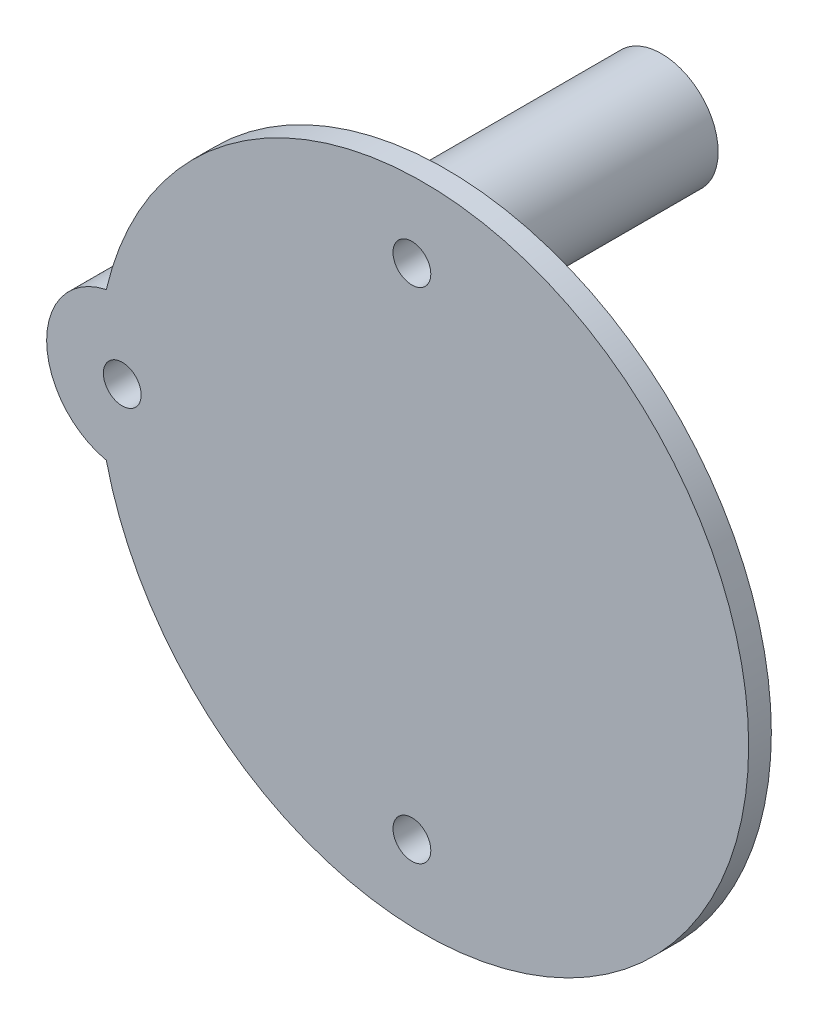
ISO-10303-21;
HEADER;
FILE_DESCRIPTION(('STEP AP214'),'2;1');
FILE_NAME('part.step','',(''),(''),'','','');
FILE_SCHEMA(('AUTOMOTIVE_DESIGN { 1 0 10303 214 1 1 1 1 }'));
ENDSEC;
DATA;
#1=APPLICATION_CONTEXT('core data for automotive mechanical design processes');
#2=APPLICATION_PROTOCOL_DEFINITION('international standard','automotive_design',2000,#1);
#3=PRODUCT_CONTEXT('',#1,'mechanical');
#4=PRODUCT('Part','Part','',(#3));
#5=PRODUCT_RELATED_PRODUCT_CATEGORY('part','',(#4));
#6=PRODUCT_DEFINITION_FORMATION('','',#4);
#7=PRODUCT_DEFINITION_CONTEXT('part definition',#1,'design');
#8=PRODUCT_DEFINITION('design','',#6,#7);
#9=PRODUCT_DEFINITION_SHAPE('','',#8);
#10=(LENGTH_UNIT() NAMED_UNIT(*) SI_UNIT(.MILLI.,.METRE.));
#11=(NAMED_UNIT(*) PLANE_ANGLE_UNIT() SI_UNIT($,.RADIAN.));
#12=(NAMED_UNIT(*) SI_UNIT($,.STERADIAN.) SOLID_ANGLE_UNIT());
#13=UNCERTAINTY_MEASURE_WITH_UNIT(LENGTH_MEASURE(1.E-05),#10,'distance_accuracy_value','');
#14=(GEOMETRIC_REPRESENTATION_CONTEXT(3) GLOBAL_UNCERTAINTY_ASSIGNED_CONTEXT((#13)) GLOBAL_UNIT_ASSIGNED_CONTEXT((#10,
#11,#12)) REPRESENTATION_CONTEXT('',''));
#15=CARTESIAN_POINT('',(0.,0.,0.));
#16=DIRECTION('',(0.,0.,1.));
#17=DIRECTION('',(1.,0.,0.));
#18=AXIS2_PLACEMENT_3D('',#15,#16,#17);
#19=CARTESIAN_POINT('',(29.,78.,0.));
#20=DIRECTION('',(0.,0.,1.));
#21=DIRECTION('',(1.,0.,0.));
#22=AXIS2_PLACEMENT_3D('',#19,#20,#21);
#23=PLANE('',#22);
#24=CARTESIAN_POINT('',(29.,78.,0.));
#25=DIRECTION('',(0.,0.,1.));
#26=DIRECTION('',(1.,0.,0.));
#27=AXIS2_PLACEMENT_3D('',#24,#25,#26);
#28=CIRCLE('',#27,7.5);
#29=CARTESIAN_POINT('',(36.5,78.,0.));
#30=VERTEX_POINT('',#29);
#31=EDGE_CURVE('E73',#30,#30,#28,.T.);
#32=ORIENTED_EDGE('',*,*,#31,.F.);
#33=EDGE_LOOP('',(#32));
#34=FACE_BOUND('',#33,.T.);
#35=CARTESIAN_POINT('',(29.,78.,0.));
#36=DIRECTION('',(0.,0.,1.));
#37=DIRECTION('',(1.,0.,0.));
#38=AXIS2_PLACEMENT_3D('',#35,#36,#37);
#39=CIRCLE('',#38,5.);
#40=CARTESIAN_POINT('',(34.,78.,0.));
#41=VERTEX_POINT('',#40);
#42=EDGE_CURVE('E93',#41,#41,#39,.T.);
#43=ORIENTED_EDGE('',*,*,#42,.T.);
#44=EDGE_LOOP('',(#43));
#45=FACE_BOUND('',#44,.T.);
#46=ADVANCED_FACE('F37',(#34,#45),#23,.F.);
#47=CARTESIAN_POINT('',(29.,78.,3.));
#48=DIRECTION('',(0.,0.,-1.));
#49=DIRECTION('',(-1.,0.,0.));
#50=AXIS2_PLACEMENT_3D('',#47,#48,#49);
#51=CYLINDRICAL_SURFACE('',#50,7.5);
#52=ORIENTED_EDGE('',*,*,#31,.T.);
#53=EDGE_LOOP('',(#52));
#54=FACE_BOUND('',#53,.T.);
#55=CARTESIAN_POINT('',(29.,78.,30.));
#56=DIRECTION('',(0.,0.,1.));
#57=DIRECTION('',(1.,0.,0.));
#58=AXIS2_PLACEMENT_3D('',#55,#56,#57);
#59=CIRCLE('',#58,7.5);
#60=CARTESIAN_POINT('',(36.5,78.,30.));
#61=VERTEX_POINT('',#60);
#62=EDGE_CURVE('E84',#61,#61,#59,.T.);
#63=ORIENTED_EDGE('',*,*,#62,.F.);
#64=EDGE_LOOP('',(#63));
#65=FACE_BOUND('',#64,.T.);
#66=ADVANCED_FACE('F39',(#54,#65),#51,.T.);
#67=CARTESIAN_POINT('',(29.,78.,3.));
#68=DIRECTION('',(0.,0.,-1.));
#69=DIRECTION('',(-1.,0.,0.));
#70=AXIS2_PLACEMENT_3D('',#67,#68,#69);
#71=CYLINDRICAL_SURFACE('',#70,5.);
#72=CARTESIAN_POINT('',(29.,78.,3.));
#73=DIRECTION('',(0.,0.,1.));
#74=DIRECTION('',(1.,0.,0.));
#75=AXIS2_PLACEMENT_3D('',#72,#73,#74);
#76=CIRCLE('',#75,5.);
#77=CARTESIAN_POINT('',(34.,78.,3.));
#78=VERTEX_POINT('',#77);
#79=EDGE_CURVE('E90',#78,#78,#76,.T.);
#80=ORIENTED_EDGE('',*,*,#79,.T.);
#81=EDGE_LOOP('',(#80));
#82=FACE_BOUND('',#81,.T.);
#83=ORIENTED_EDGE('',*,*,#42,.F.);
#84=EDGE_LOOP('',(#83));
#85=FACE_BOUND('',#84,.T.);
#86=ADVANCED_FACE('F153',(#82,#85),#71,.F.);
#87=CARTESIAN_POINT('',(29.,78.,3.));
#88=DIRECTION('',(0.,0.,1.));
#89=DIRECTION('',(1.,0.,0.));
#90=AXIS2_PLACEMENT_3D('',#87,#88,#89);
#91=PLANE('',#90);
#92=CARTESIAN_POINT('',(29.,78.,3.));
#93=DIRECTION('',(0.,0.,1.));
#94=DIRECTION('',(1.,0.,0.));
#95=AXIS2_PLACEMENT_3D('',#92,#93,#94);
#96=CIRCLE('',#95,2.5);
#97=CARTESIAN_POINT('',(31.5,78.,3.));
#98=VERTEX_POINT('',#97);
#99=EDGE_CURVE('E103',#98,#98,#96,.T.);
#100=ORIENTED_EDGE('',*,*,#99,.T.);
#101=EDGE_LOOP('',(#100));
#102=FACE_BOUND('',#101,.T.);
#103=ORIENTED_EDGE('',*,*,#79,.F.);
#104=EDGE_LOOP('',(#103));
#105=FACE_BOUND('',#104,.T.);
#106=ADVANCED_FACE('F160',(#102,#105),#91,.F.);
#107=CARTESIAN_POINT('',(-9.29999999999999,45.,33.));
#108=DIRECTION('',(0.,0.,-1.));
#109=DIRECTION('',(-1.,0.,0.));
#110=AXIS2_PLACEMENT_3D('',#107,#108,#109);
#111=CYLINDRICAL_SURFACE('',#110,10.);
#112=DIRECTION('',(0.,0.,-1.));
#113=VECTOR('',#112,1.);
#114=CARTESIAN_POINT('',(-11.4091892759593,54.7750355804048,33.));
#115=LINE('',#114,#113);
#116=CARTESIAN_POINT('',(-11.4091892759593,54.7750355804048,33.));
#117=VERTEX_POINT('',#116);
#118=CARTESIAN_POINT('',(-11.4091892759593,54.7750355804048,30.));
#119=VERTEX_POINT('',#118);
#120=EDGE_CURVE('E76',#117,#119,#115,.T.);
#121=ORIENTED_EDGE('',*,*,#120,.T.);
#122=CARTESIAN_POINT('',(-9.29999999999999,45.,30.));
#123=DIRECTION('',(0.,0.,1.));
#124=DIRECTION('',(1.,0.,0.));
#125=AXIS2_PLACEMENT_3D('',#122,#123,#124);
#126=CIRCLE('',#125,9.99999999999999);
#127=CARTESIAN_POINT('',(-11.4091892759592,35.2249644195953,30.));
#128=VERTEX_POINT('',#127);
#129=EDGE_CURVE('E47',#119,#128,#126,.F.);
#130=ORIENTED_EDGE('',*,*,#129,.T.);
#131=DIRECTION('',(0.,0.,-1.));
#132=VECTOR('',#131,1.);
#133=CARTESIAN_POINT('',(-11.4091892759592,35.2249644195953,33.));
#134=LINE('',#133,#132);
#135=CARTESIAN_POINT('',(-11.4091892759592,35.2249644195953,33.));
#136=VERTEX_POINT('',#135);
#137=EDGE_CURVE('E63',#136,#128,#134,.T.);
#138=ORIENTED_EDGE('',*,*,#137,.F.);
#139=CARTESIAN_POINT('',(-9.29999999999999,45.,33.));
#140=DIRECTION('',(0.,0.,1.));
#141=DIRECTION('',(1.,0.,0.));
#142=AXIS2_PLACEMENT_3D('',#139,#140,#141);
#143=CIRCLE('',#142,10.);
#144=EDGE_CURVE('E78',#117,#136,#143,.T.);
#145=ORIENTED_EDGE('',*,*,#144,.F.);
#146=EDGE_LOOP('',(#121,#130,#138,#145));
#147=FACE_BOUND('',#146,.T.);
#148=CARTESIAN_POINT('',(-9.29999999999999,45.,0.));
#149=DIRECTION('',(0.,0.,1.));
#150=DIRECTION('',(1.,0.,0.));
#151=AXIS2_PLACEMENT_3D('',#148,#149,#150);
#152=CIRCLE('',#151,9.99999999999999);
#153=CARTESIAN_POINT('',(0.700000000000004,45.,0.));
#154=VERTEX_POINT('',#153);
#155=EDGE_CURVE('E79',#154,#154,#152,.T.);
#156=ORIENTED_EDGE('',*,*,#155,.T.);
#157=EDGE_LOOP('',(#156));
#158=FACE_BOUND('',#157,.T.);
#159=ADVANCED_FACE('F81',(#147,#158),#111,.T.);
#160=CARTESIAN_POINT('',(30.5,45.,33.));
#161=DIRECTION('',(0.,0.,-1.));
#162=DIRECTION('',(-1.,0.,0.));
#163=AXIS2_PLACEMENT_3D('',#160,#161,#162);
#164=CYLINDRICAL_SURFACE('',#163,43.0340733183179);
#165=CARTESIAN_POINT('',(30.5,45.,30.));
#166=DIRECTION('',(0.,0.,1.));
#167=DIRECTION('',(1.,0.,0.));
#168=AXIS2_PLACEMENT_3D('',#165,#166,#167);
#169=CIRCLE('',#168,43.0340733183179);
#170=EDGE_CURVE('E70',#128,#119,#169,.T.);
#171=ORIENTED_EDGE('',*,*,#170,.T.);
#172=ORIENTED_EDGE('',*,*,#120,.F.);
#173=CARTESIAN_POINT('',(30.5,45.,33.));
#174=DIRECTION('',(0.,0.,1.));
#175=DIRECTION('',(1.,0.,0.));
#176=AXIS2_PLACEMENT_3D('',#173,#174,#175);
#177=CIRCLE('',#176,43.0340733183179);
#178=EDGE_CURVE('E54',#136,#117,#177,.T.);
#179=ORIENTED_EDGE('',*,*,#178,.F.);
#180=ORIENTED_EDGE('',*,*,#137,.T.);
#181=EDGE_LOOP('',(#171,#172,#179,#180));
#182=FACE_BOUND('',#181,.T.);
#183=ADVANCED_FACE('F75',(#182),#164,.T.);
#184=CARTESIAN_POINT('',(10.6,45.,33.));
#185=DIRECTION('',(0.,0.,1.));
#186=DIRECTION('',(1.,0.,0.));
#187=AXIS2_PLACEMENT_3D('',#184,#185,#186);
#188=PLANE('',#187);
#189=CARTESIAN_POINT('',(-9.29999999999999,45.,33.));
#190=DIRECTION('',(0.,0.,1.));
#191=DIRECTION('',(1.,0.,0.));
#192=AXIS2_PLACEMENT_3D('',#189,#190,#191);
#193=CIRCLE('',#192,2.5);
#194=CARTESIAN_POINT('',(-6.79999999999999,45.,33.));
#195=VERTEX_POINT('',#194);
#196=EDGE_CURVE('E99',#195,#195,#193,.T.);
#197=ORIENTED_EDGE('',*,*,#196,.F.);
#198=EDGE_LOOP('',(#197));
#199=FACE_BOUND('',#198,.T.);
#200=CARTESIAN_POINT('',(29.,12.,33.));
#201=DIRECTION('',(0.,0.,1.));
#202=DIRECTION('',(1.,0.,0.));
#203=AXIS2_PLACEMENT_3D('',#200,#201,#202);
#204=CIRCLE('',#203,2.5);
#205=CARTESIAN_POINT('',(31.5,12.,33.));
#206=VERTEX_POINT('',#205);
#207=EDGE_CURVE('E105',#206,#206,#204,.T.);
#208=ORIENTED_EDGE('',*,*,#207,.F.);
#209=EDGE_LOOP('',(#208));
#210=FACE_BOUND('',#209,.T.);
#211=CARTESIAN_POINT('',(29.,78.,33.));
#212=DIRECTION('',(0.,0.,1.));
#213=DIRECTION('',(1.,0.,0.));
#214=AXIS2_PLACEMENT_3D('',#211,#212,#213);
#215=CIRCLE('',#214,2.5);
#216=CARTESIAN_POINT('',(31.5,78.,33.));
#217=VERTEX_POINT('',#216);
#218=EDGE_CURVE('E110',#217,#217,#215,.T.);
#219=ORIENTED_EDGE('',*,*,#218,.F.);
#220=EDGE_LOOP('',(#219));
#221=FACE_BOUND('',#220,.T.);
#222=ORIENTED_EDGE('',*,*,#144,.T.);
#223=ORIENTED_EDGE('',*,*,#178,.T.);
#224=EDGE_LOOP('',(#222,#223));
#225=FACE_BOUND('',#224,.T.);
#226=ADVANCED_FACE('F134',(#199,#210,#221,#225),#188,.T.);
#227=CARTESIAN_POINT('',(10.6,45.,30.));
#228=DIRECTION('',(0.,0.,1.));
#229=DIRECTION('',(1.,0.,0.));
#230=AXIS2_PLACEMENT_3D('',#227,#228,#229);
#231=PLANE('',#230);
#232=CARTESIAN_POINT('',(29.,12.,30.));
#233=DIRECTION('',(0.,0.,1.));
#234=DIRECTION('',(1.,0.,0.));
#235=AXIS2_PLACEMENT_3D('',#232,#233,#234);
#236=CIRCLE('',#235,7.);
#237=CARTESIAN_POINT('',(36.,12.,30.));
#238=VERTEX_POINT('',#237);
#239=EDGE_CURVE('E11',#238,#238,#236,.F.);
#240=ORIENTED_EDGE('',*,*,#239,.F.);
#241=EDGE_LOOP('',(#240));
#242=FACE_BOUND('',#241,.T.);
#243=ORIENTED_EDGE('',*,*,#129,.F.);
#244=ORIENTED_EDGE('',*,*,#170,.F.);
#245=EDGE_LOOP('',(#243,#244));
#246=FACE_BOUND('',#245,.T.);
#247=ORIENTED_EDGE('',*,*,#62,.T.);
#248=EDGE_LOOP('',(#247));
#249=FACE_BOUND('',#248,.T.);
#250=ADVANCED_FACE('F68',(#242,#246,#249),#231,.F.);
#251=CARTESIAN_POINT('',(-9.29999999999999,45.,0.));
#252=DIRECTION('',(0.,0.,1.));
#253=DIRECTION('',(1.,0.,0.));
#254=AXIS2_PLACEMENT_3D('',#251,#252,#253);
#255=PLANE('',#254);
#256=ORIENTED_EDGE('',*,*,#155,.F.);
#257=EDGE_LOOP('',(#256));
#258=FACE_BOUND('',#257,.T.);
#259=CARTESIAN_POINT('',(-9.29999999999999,45.,0.));
#260=DIRECTION('',(0.,0.,1.));
#261=DIRECTION('',(1.,0.,0.));
#262=AXIS2_PLACEMENT_3D('',#259,#260,#261);
#263=CIRCLE('',#262,5.);
#264=CARTESIAN_POINT('',(-4.29999999999999,45.,0.));
#265=VERTEX_POINT('',#264);
#266=EDGE_CURVE('E129',#265,#265,#263,.T.);
#267=ORIENTED_EDGE('',*,*,#266,.T.);
#268=EDGE_LOOP('',(#267));
#269=FACE_BOUND('',#268,.T.);
#270=ADVANCED_FACE('F142',(#258,#269),#255,.F.);
#271=CARTESIAN_POINT('',(-9.29999999999999,45.,3.));
#272=DIRECTION('',(0.,0.,-1.));
#273=DIRECTION('',(-1.,0.,0.));
#274=AXIS2_PLACEMENT_3D('',#271,#272,#273);
#275=CYLINDRICAL_SURFACE('',#274,5.);
#276=CARTESIAN_POINT('',(-9.29999999999999,45.,3.));
#277=DIRECTION('',(0.,0.,1.));
#278=DIRECTION('',(1.,0.,0.));
#279=AXIS2_PLACEMENT_3D('',#276,#277,#278);
#280=CIRCLE('',#279,5.);
#281=CARTESIAN_POINT('',(-4.29999999999999,45.,3.));
#282=VERTEX_POINT('',#281);
#283=EDGE_CURVE('E126',#282,#282,#280,.T.);
#284=ORIENTED_EDGE('',*,*,#283,.T.);
#285=EDGE_LOOP('',(#284));
#286=FACE_BOUND('',#285,.T.);
#287=ORIENTED_EDGE('',*,*,#266,.F.);
#288=EDGE_LOOP('',(#287));
#289=FACE_BOUND('',#288,.T.);
#290=ADVANCED_FACE('F192',(#286,#289),#275,.F.);
#291=CARTESIAN_POINT('',(-9.29999999999999,45.,3.));
#292=DIRECTION('',(0.,0.,1.));
#293=DIRECTION('',(1.,0.,0.));
#294=AXIS2_PLACEMENT_3D('',#291,#292,#293);
#295=PLANE('',#294);
#296=CARTESIAN_POINT('',(-9.29999999999999,45.,3.));
#297=DIRECTION('',(0.,0.,1.));
#298=DIRECTION('',(1.,0.,0.));
#299=AXIS2_PLACEMENT_3D('',#296,#297,#298);
#300=CIRCLE('',#299,2.5);
#301=CARTESIAN_POINT('',(-6.79999999999999,45.,3.));
#302=VERTEX_POINT('',#301);
#303=EDGE_CURVE('E41',#302,#302,#300,.T.);
#304=ORIENTED_EDGE('',*,*,#303,.T.);
#305=EDGE_LOOP('',(#304));
#306=FACE_BOUND('',#305,.T.);
#307=ORIENTED_EDGE('',*,*,#283,.F.);
#308=EDGE_LOOP('',(#307));
#309=FACE_BOUND('',#308,.T.);
#310=ADVANCED_FACE('F202',(#306,#309),#295,.F.);
#311=CARTESIAN_POINT('',(29.,12.,0.));
#312=DIRECTION('',(0.,0.,1.));
#313=DIRECTION('',(1.,0.,0.));
#314=AXIS2_PLACEMENT_3D('',#311,#312,#313);
#315=PLANE('',#314);
#316=CARTESIAN_POINT('',(29.,12.,0.));
#317=DIRECTION('',(0.,0.,1.));
#318=DIRECTION('',(1.,0.,0.));
#319=AXIS2_PLACEMENT_3D('',#316,#317,#318);
#320=CIRCLE('',#319,7.);
#321=CARTESIAN_POINT('',(36.,12.,0.));
#322=VERTEX_POINT('',#321);
#323=EDGE_CURVE('E123',#322,#322,#320,.T.);
#324=ORIENTED_EDGE('',*,*,#323,.F.);
#325=EDGE_LOOP('',(#324));
#326=FACE_BOUND('',#325,.T.);
#327=CARTESIAN_POINT('',(29.,12.,0.));
#328=DIRECTION('',(0.,0.,1.));
#329=DIRECTION('',(1.,0.,0.));
#330=AXIS2_PLACEMENT_3D('',#327,#328,#329);
#331=CIRCLE('',#330,5.);
#332=CARTESIAN_POINT('',(34.,12.,0.));
#333=VERTEX_POINT('',#332);
#334=EDGE_CURVE('E120',#333,#333,#331,.T.);
#335=ORIENTED_EDGE('',*,*,#334,.T.);
#336=EDGE_LOOP('',(#335));
#337=FACE_BOUND('',#336,.T.);
#338=ADVANCED_FACE('F210',(#326,#337),#315,.F.);
#339=CARTESIAN_POINT('',(29.,12.,3.));
#340=DIRECTION('',(0.,0.,-1.));
#341=DIRECTION('',(-1.,0.,0.));
#342=AXIS2_PLACEMENT_3D('',#339,#340,#341);
#343=CYLINDRICAL_SURFACE('',#342,7.);
#344=ORIENTED_EDGE('',*,*,#323,.T.);
#345=EDGE_LOOP('',(#344));
#346=FACE_BOUND('',#345,.T.);
#347=ORIENTED_EDGE('',*,*,#239,.T.);
#348=EDGE_LOOP('',(#347));
#349=FACE_BOUND('',#348,.T.);
#350=ADVANCED_FACE('F215',(#346,#349),#343,.T.);
#351=CARTESIAN_POINT('',(29.,12.,3.));
#352=DIRECTION('',(0.,0.,-1.));
#353=DIRECTION('',(-1.,0.,0.));
#354=AXIS2_PLACEMENT_3D('',#351,#352,#353);
#355=CYLINDRICAL_SURFACE('',#354,5.);
#356=CARTESIAN_POINT('',(29.,12.,3.));
#357=DIRECTION('',(0.,0.,1.));
#358=DIRECTION('',(1.,0.,0.));
#359=AXIS2_PLACEMENT_3D('',#356,#357,#358);
#360=CIRCLE('',#359,5.);
#361=CARTESIAN_POINT('',(34.,12.,3.));
#362=VERTEX_POINT('',#361);
#363=EDGE_CURVE('E117',#362,#362,#360,.T.);
#364=ORIENTED_EDGE('',*,*,#363,.T.);
#365=EDGE_LOOP('',(#364));
#366=FACE_BOUND('',#365,.T.);
#367=ORIENTED_EDGE('',*,*,#334,.F.);
#368=EDGE_LOOP('',(#367));
#369=FACE_BOUND('',#368,.T.);
#370=ADVANCED_FACE('F226',(#366,#369),#355,.F.);
#371=CARTESIAN_POINT('',(29.,12.,3.));
#372=DIRECTION('',(0.,0.,1.));
#373=DIRECTION('',(1.,0.,0.));
#374=AXIS2_PLACEMENT_3D('',#371,#372,#373);
#375=PLANE('',#374);
#376=CARTESIAN_POINT('',(29.,12.,3.));
#377=DIRECTION('',(0.,0.,1.));
#378=DIRECTION('',(1.,0.,0.));
#379=AXIS2_PLACEMENT_3D('',#376,#377,#378);
#380=CIRCLE('',#379,2.5);
#381=CARTESIAN_POINT('',(31.5,12.,3.));
#382=VERTEX_POINT('',#381);
#383=EDGE_CURVE('E97',#382,#382,#380,.T.);
#384=ORIENTED_EDGE('',*,*,#383,.T.);
#385=EDGE_LOOP('',(#384));
#386=FACE_BOUND('',#385,.T.);
#387=ORIENTED_EDGE('',*,*,#363,.F.);
#388=EDGE_LOOP('',(#387));
#389=FACE_BOUND('',#388,.T.);
#390=ADVANCED_FACE('F236',(#386,#389),#375,.F.);
#391=CARTESIAN_POINT('',(29.,12.,0.));
#392=DIRECTION('',(0.,0.,1.));
#393=DIRECTION('',(1.,0.,0.));
#394=AXIS2_PLACEMENT_3D('',#391,#392,#393);
#395=CYLINDRICAL_SURFACE('',#394,2.5);
#396=ORIENTED_EDGE('',*,*,#207,.T.);
#397=EDGE_LOOP('',(#396));
#398=FACE_BOUND('',#397,.T.);
#399=ORIENTED_EDGE('',*,*,#383,.F.);
#400=EDGE_LOOP('',(#399));
#401=FACE_BOUND('',#400,.T.);
#402=ADVANCED_FACE('F262',(#398,#401),#395,.F.);
#403=CARTESIAN_POINT('',(-9.29999999999999,45.,0.));
#404=DIRECTION('',(0.,0.,1.));
#405=DIRECTION('',(1.,0.,0.));
#406=AXIS2_PLACEMENT_3D('',#403,#404,#405);
#407=CYLINDRICAL_SURFACE('',#406,2.5);
#408=ORIENTED_EDGE('',*,*,#196,.T.);
#409=EDGE_LOOP('',(#408));
#410=FACE_BOUND('',#409,.T.);
#411=ORIENTED_EDGE('',*,*,#303,.F.);
#412=EDGE_LOOP('',(#411));
#413=FACE_BOUND('',#412,.T.);
#414=ADVANCED_FACE('F270',(#410,#413),#407,.F.);
#415=CARTESIAN_POINT('',(29.,78.,0.));
#416=DIRECTION('',(0.,0.,1.));
#417=DIRECTION('',(1.,0.,0.));
#418=AXIS2_PLACEMENT_3D('',#415,#416,#417);
#419=CYLINDRICAL_SURFACE('',#418,2.5);
#420=ORIENTED_EDGE('',*,*,#218,.T.);
#421=EDGE_LOOP('',(#420));
#422=FACE_BOUND('',#421,.T.);
#423=ORIENTED_EDGE('',*,*,#99,.F.);
#424=EDGE_LOOP('',(#423));
#425=FACE_BOUND('',#424,.T.);
#426=ADVANCED_FACE('F280',(#422,#425),#419,.F.);
#427=CLOSED_SHELL('',(#46,#66,#86,#106,#159,#183,#226,#250,#270,#290,#310,#338,#350,#370,#390,
#402,#414,#426));
#428=MANIFOLD_SOLID_BREP('B2',#427);
#429=ADVANCED_BREP_SHAPE_REPRESENTATION('',(#18,#428),#14);
#430=SHAPE_DEFINITION_REPRESENTATION(#9,#429);
ENDSEC;
END-ISO-10303-21;
